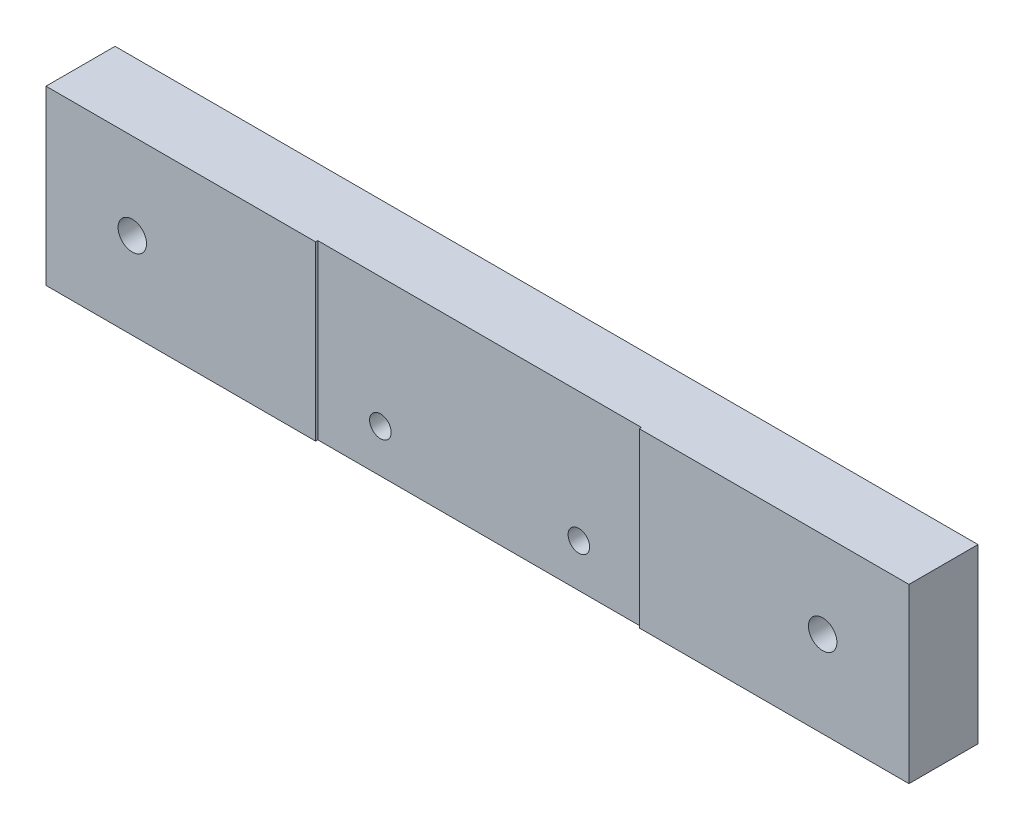
ISO-10303-21;
HEADER;
FILE_DESCRIPTION(('STEP AP214'),'2;1');
FILE_NAME('part.step','',(''),(''),'','','');
FILE_SCHEMA(('AUTOMOTIVE_DESIGN { 1 0 10303 214 1 1 1 1 }'));
ENDSEC;
DATA;
#1=APPLICATION_CONTEXT('core data for automotive mechanical design processes');
#2=APPLICATION_PROTOCOL_DEFINITION('international standard','automotive_design',2000,#1);
#3=PRODUCT_CONTEXT('',#1,'mechanical');
#4=PRODUCT('Part','Part','',(#3));
#5=PRODUCT_RELATED_PRODUCT_CATEGORY('part','',(#4));
#6=PRODUCT_DEFINITION_FORMATION('','',#4);
#7=PRODUCT_DEFINITION_CONTEXT('part definition',#1,'design');
#8=PRODUCT_DEFINITION('design','',#6,#7);
#9=PRODUCT_DEFINITION_SHAPE('','',#8);
#10=(LENGTH_UNIT() NAMED_UNIT(*) SI_UNIT(.MILLI.,.METRE.));
#11=(NAMED_UNIT(*) PLANE_ANGLE_UNIT() SI_UNIT($,.RADIAN.));
#12=(NAMED_UNIT(*) SI_UNIT($,.STERADIAN.) SOLID_ANGLE_UNIT());
#13=UNCERTAINTY_MEASURE_WITH_UNIT(LENGTH_MEASURE(1.E-05),#10,'distance_accuracy_value','');
#14=(GEOMETRIC_REPRESENTATION_CONTEXT(3) GLOBAL_UNCERTAINTY_ASSIGNED_CONTEXT((#13)) GLOBAL_UNIT_ASSIGNED_CONTEXT((#10,
#11,#12)) REPRESENTATION_CONTEXT('',''));
#15=CARTESIAN_POINT('',(0.,0.,0.));
#16=DIRECTION('',(0.,0.,1.));
#17=DIRECTION('',(1.,0.,0.));
#18=AXIS2_PLACEMENT_3D('',#15,#16,#17);
#19=CARTESIAN_POINT('',(-100.,20.,16.));
#20=DIRECTION('',(0.,-1.,0.));
#21=DIRECTION('',(0.,0.,-1.));
#22=AXIS2_PLACEMENT_3D('',#19,#20,#21);
#23=PLANE('',#22);
#24=DIRECTION('',(0.,0.,1.));
#25=VECTOR('',#24,1.);
#26=CARTESIAN_POINT('',(-37.5,20.,15.5));
#27=LINE('',#26,#25);
#28=CARTESIAN_POINT('',(-37.5,20.,15.5));
#29=VERTEX_POINT('',#28);
#30=CARTESIAN_POINT('',(-37.5,20.,16.));
#31=VERTEX_POINT('',#30);
#32=EDGE_CURVE('E127',#29,#31,#27,.T.);
#33=ORIENTED_EDGE('',*,*,#32,.F.);
#34=DIRECTION('',(1.,0.,0.));
#35=VECTOR('',#34,1.);
#36=CARTESIAN_POINT('',(37.5,20.,15.5));
#37=LINE('',#36,#35);
#38=CARTESIAN_POINT('',(37.5,20.,15.5));
#39=VERTEX_POINT('',#38);
#40=EDGE_CURVE('E116',#29,#39,#37,.T.);
#41=ORIENTED_EDGE('',*,*,#40,.T.);
#42=DIRECTION('',(0.,0.,1.));
#43=VECTOR('',#42,1.);
#44=CARTESIAN_POINT('',(37.5,20.,15.5));
#45=LINE('',#44,#43);
#46=CARTESIAN_POINT('',(37.5,20.,16.));
#47=VERTEX_POINT('',#46);
#48=EDGE_CURVE('E137',#39,#47,#45,.T.);
#49=ORIENTED_EDGE('',*,*,#48,.T.);
#50=DIRECTION('',(-1.,0.,0.));
#51=VECTOR('',#50,1.);
#52=CARTESIAN_POINT('',(-100.,20.,16.));
#53=LINE('',#52,#51);
#54=CARTESIAN_POINT('',(100.,20.,16.));
#55=VERTEX_POINT('',#54);
#56=EDGE_CURVE('E92',#55,#47,#53,.T.);
#57=ORIENTED_EDGE('',*,*,#56,.F.);
#58=DIRECTION('',(0.,0.,-1.));
#59=VECTOR('',#58,1.);
#60=CARTESIAN_POINT('',(100.,20.,16.));
#61=LINE('',#60,#59);
#62=CARTESIAN_POINT('',(100.,20.,0.));
#63=VERTEX_POINT('',#62);
#64=EDGE_CURVE('E11',#55,#63,#61,.T.);
#65=ORIENTED_EDGE('',*,*,#64,.T.);
#66=DIRECTION('',(-1.,0.,0.));
#67=VECTOR('',#66,1.);
#68=CARTESIAN_POINT('',(-100.,20.,0.));
#69=LINE('',#68,#67);
#70=CARTESIAN_POINT('',(-100.,20.,0.));
#71=VERTEX_POINT('',#70);
#72=EDGE_CURVE('E140',#63,#71,#69,.T.);
#73=ORIENTED_EDGE('',*,*,#72,.T.);
#74=DIRECTION('',(0.,0.,-1.));
#75=VECTOR('',#74,1.);
#76=CARTESIAN_POINT('',(-100.,20.,16.));
#77=LINE('',#76,#75);
#78=CARTESIAN_POINT('',(-100.,20.,16.));
#79=VERTEX_POINT('',#78);
#80=EDGE_CURVE('E48',#79,#71,#77,.T.);
#81=ORIENTED_EDGE('',*,*,#80,.F.);
#82=EDGE_CURVE('E135',#31,#79,#53,.T.);
#83=ORIENTED_EDGE('',*,*,#82,.F.);
#84=EDGE_LOOP('',(#33,#41,#49,#57,#65,#73,#81,#83));
#85=FACE_BOUND('',#84,.T.);
#86=ADVANCED_FACE('F40',(#85),#23,.F.);
#87=CARTESIAN_POINT('',(-100.,-20.,16.));
#88=DIRECTION('',(0.,1.,0.));
#89=DIRECTION('',(0.,0.,1.));
#90=AXIS2_PLACEMENT_3D('',#87,#88,#89);
#91=PLANE('',#90);
#92=DIRECTION('',(0.,0.,1.));
#93=VECTOR('',#92,1.);
#94=CARTESIAN_POINT('',(-37.5,-20.,15.5));
#95=LINE('',#94,#93);
#96=CARTESIAN_POINT('',(-37.5,-20.,15.5));
#97=VERTEX_POINT('',#96);
#98=CARTESIAN_POINT('',(-37.5,-20.,16.));
#99=VERTEX_POINT('',#98);
#100=EDGE_CURVE('E130',#97,#99,#95,.T.);
#101=ORIENTED_EDGE('',*,*,#100,.T.);
#102=DIRECTION('',(1.,0.,0.));
#103=VECTOR('',#102,1.);
#104=CARTESIAN_POINT('',(-100.,-20.,16.));
#105=LINE('',#104,#103);
#106=CARTESIAN_POINT('',(-100.,-20.,16.));
#107=VERTEX_POINT('',#106);
#108=EDGE_CURVE('E150',#107,#99,#105,.T.);
#109=ORIENTED_EDGE('',*,*,#108,.F.);
#110=DIRECTION('',(0.,0.,-1.));
#111=VECTOR('',#110,1.);
#112=CARTESIAN_POINT('',(-100.,-20.,16.));
#113=LINE('',#112,#111);
#114=CARTESIAN_POINT('',(-100.,-20.,0.));
#115=VERTEX_POINT('',#114);
#116=EDGE_CURVE('E159',#107,#115,#113,.T.);
#117=ORIENTED_EDGE('',*,*,#116,.T.);
#118=DIRECTION('',(1.,0.,0.));
#119=VECTOR('',#118,1.);
#120=CARTESIAN_POINT('',(-100.,-20.,0.));
#121=LINE('',#120,#119);
#122=CARTESIAN_POINT('',(100.,-20.,0.));
#123=VERTEX_POINT('',#122);
#124=EDGE_CURVE('E85',#115,#123,#121,.T.);
#125=ORIENTED_EDGE('',*,*,#124,.T.);
#126=DIRECTION('',(0.,0.,-1.));
#127=VECTOR('',#126,1.);
#128=CARTESIAN_POINT('',(100.,-20.,16.));
#129=LINE('',#128,#127);
#130=CARTESIAN_POINT('',(100.,-20.,16.));
#131=VERTEX_POINT('',#130);
#132=EDGE_CURVE('E152',#131,#123,#129,.T.);
#133=ORIENTED_EDGE('',*,*,#132,.F.);
#134=CARTESIAN_POINT('',(37.5,-20.,16.));
#135=VERTEX_POINT('',#134);
#136=EDGE_CURVE('E63',#135,#131,#105,.T.);
#137=ORIENTED_EDGE('',*,*,#136,.F.);
#138=DIRECTION('',(0.,0.,1.));
#139=VECTOR('',#138,1.);
#140=CARTESIAN_POINT('',(37.5,-20.,15.5));
#141=LINE('',#140,#139);
#142=CARTESIAN_POINT('',(37.5,-20.,15.5));
#143=VERTEX_POINT('',#142);
#144=EDGE_CURVE('E55',#143,#135,#141,.T.);
#145=ORIENTED_EDGE('',*,*,#144,.F.);
#146=DIRECTION('',(-1.,0.,0.));
#147=VECTOR('',#146,1.);
#148=CARTESIAN_POINT('',(37.5,-20.,15.5));
#149=LINE('',#148,#147);
#150=EDGE_CURVE('E173',#143,#97,#149,.T.);
#151=ORIENTED_EDGE('',*,*,#150,.T.);
#152=EDGE_LOOP('',(#101,#109,#117,#125,#133,#137,#145,#151));
#153=FACE_BOUND('',#152,.T.);
#154=ADVANCED_FACE('F172',(#153),#91,.F.);
#155=CARTESIAN_POINT('',(0.,0.,16.));
#156=DIRECTION('',(0.,0.,1.));
#157=DIRECTION('',(1.,0.,0.));
#158=AXIS2_PLACEMENT_3D('',#155,#156,#157);
#159=PLANE('',#158);
#160=CARTESIAN_POINT('',(-80.,0.,16.));
#161=DIRECTION('',(0.,0.,-1.));
#162=DIRECTION('',(-1.,0.,0.));
#163=AXIS2_PLACEMENT_3D('',#160,#161,#162);
#164=CIRCLE('',#163,3.3);
#165=CARTESIAN_POINT('',(-83.3,0.,16.));
#166=VERTEX_POINT('',#165);
#167=EDGE_CURVE('E193',#166,#166,#164,.T.);
#168=ORIENTED_EDGE('',*,*,#167,.T.);
#169=EDGE_LOOP('',(#168));
#170=FACE_BOUND('',#169,.T.);
#171=ORIENTED_EDGE('',*,*,#108,.T.);
#172=DIRECTION('',(0.,1.,0.));
#173=VECTOR('',#172,1.);
#174=CARTESIAN_POINT('',(-37.5,20.,16.));
#175=LINE('',#174,#173);
#176=EDGE_CURVE('E177',#99,#31,#175,.T.);
#177=ORIENTED_EDGE('',*,*,#176,.T.);
#178=ORIENTED_EDGE('',*,*,#82,.T.);
#179=DIRECTION('',(0.,-1.,0.));
#180=VECTOR('',#179,1.);
#181=CARTESIAN_POINT('',(-100.,20.,16.));
#182=LINE('',#181,#180);
#183=EDGE_CURVE('E148',#79,#107,#182,.T.);
#184=ORIENTED_EDGE('',*,*,#183,.T.);
#185=EDGE_LOOP('',(#171,#177,#178,#184));
#186=FACE_BOUND('',#185,.T.);
#187=ADVANCED_FACE('F249',(#170,#186),#159,.T.);
#188=CARTESIAN_POINT('',(80.,0.,16.));
#189=DIRECTION('',(0.,0.,-1.));
#190=DIRECTION('',(-1.,0.,0.));
#191=AXIS2_PLACEMENT_3D('',#188,#189,#190);
#192=CIRCLE('',#191,3.3);
#193=CARTESIAN_POINT('',(76.7,0.,16.));
#194=VERTEX_POINT('',#193);
#195=EDGE_CURVE('E205',#194,#194,#192,.T.);
#196=ORIENTED_EDGE('',*,*,#195,.T.);
#197=EDGE_LOOP('',(#196));
#198=FACE_BOUND('',#197,.T.);
#199=ORIENTED_EDGE('',*,*,#56,.T.);
#200=DIRECTION('',(0.,-1.,0.));
#201=VECTOR('',#200,1.);
#202=CARTESIAN_POINT('',(37.5,20.,16.));
#203=LINE('',#202,#201);
#204=EDGE_CURVE('E131',#47,#135,#203,.T.);
#205=ORIENTED_EDGE('',*,*,#204,.T.);
#206=ORIENTED_EDGE('',*,*,#136,.T.);
#207=DIRECTION('',(0.,1.,0.));
#208=VECTOR('',#207,1.);
#209=CARTESIAN_POINT('',(100.,20.,16.));
#210=LINE('',#209,#208);
#211=EDGE_CURVE('E145',#131,#55,#210,.T.);
#212=ORIENTED_EDGE('',*,*,#211,.T.);
#213=EDGE_LOOP('',(#199,#205,#206,#212));
#214=FACE_BOUND('',#213,.T.);
#215=ADVANCED_FACE('F256',(#198,#214),#159,.T.);
#216=CARTESIAN_POINT('',(100.,20.,16.));
#217=DIRECTION('',(-1.,0.,0.));
#218=DIRECTION('',(0.,0.,1.));
#219=AXIS2_PLACEMENT_3D('',#216,#217,#218);
#220=PLANE('',#219);
#221=DIRECTION('',(0.,1.,0.));
#222=VECTOR('',#221,1.);
#223=CARTESIAN_POINT('',(100.,20.,0.));
#224=LINE('',#223,#222);
#225=EDGE_CURVE('E136',#123,#63,#224,.T.);
#226=ORIENTED_EDGE('',*,*,#225,.T.);
#227=ORIENTED_EDGE('',*,*,#64,.F.);
#228=ORIENTED_EDGE('',*,*,#211,.F.);
#229=ORIENTED_EDGE('',*,*,#132,.T.);
#230=EDGE_LOOP('',(#226,#227,#228,#229));
#231=FACE_BOUND('',#230,.T.);
#232=ADVANCED_FACE('F42',(#231),#220,.F.);
#233=CARTESIAN_POINT('',(-100.,20.,16.));
#234=DIRECTION('',(1.,0.,0.));
#235=DIRECTION('',(0.,0.,-1.));
#236=AXIS2_PLACEMENT_3D('',#233,#234,#235);
#237=PLANE('',#236);
#238=DIRECTION('',(0.,-1.,0.));
#239=VECTOR('',#238,1.);
#240=CARTESIAN_POINT('',(-100.,20.,0.));
#241=LINE('',#240,#239);
#242=EDGE_CURVE('E155',#71,#115,#241,.T.);
#243=ORIENTED_EDGE('',*,*,#242,.T.);
#244=ORIENTED_EDGE('',*,*,#116,.F.);
#245=ORIENTED_EDGE('',*,*,#183,.F.);
#246=ORIENTED_EDGE('',*,*,#80,.T.);
#247=EDGE_LOOP('',(#243,#244,#245,#246));
#248=FACE_BOUND('',#247,.T.);
#249=ADVANCED_FACE('F164',(#248),#237,.F.);
#250=CARTESIAN_POINT('',(0.,0.,0.));
#251=DIRECTION('',(0.,0.,1.));
#252=DIRECTION('',(1.,0.,0.));
#253=AXIS2_PLACEMENT_3D('',#250,#251,#252);
#254=PLANE('',#253);
#255=CARTESIAN_POINT('',(80.,0.,0.));
#256=DIRECTION('',(0.,0.,-1.));
#257=DIRECTION('',(-1.,0.,0.));
#258=AXIS2_PLACEMENT_3D('',#255,#256,#257);
#259=CIRCLE('',#258,5.49999999999999);
#260=CARTESIAN_POINT('',(74.5,0.,0.));
#261=VERTEX_POINT('',#260);
#262=EDGE_CURVE('E214',#261,#261,#259,.T.);
#263=ORIENTED_EDGE('',*,*,#262,.F.);
#264=EDGE_LOOP('',(#263));
#265=FACE_BOUND('',#264,.T.);
#266=CARTESIAN_POINT('',(-80.,0.,0.));
#267=DIRECTION('',(0.,0.,-1.));
#268=DIRECTION('',(-1.,0.,0.));
#269=AXIS2_PLACEMENT_3D('',#266,#267,#268);
#270=CIRCLE('',#269,5.49999999999999);
#271=CARTESIAN_POINT('',(-85.5,0.,0.));
#272=VERTEX_POINT('',#271);
#273=EDGE_CURVE('E202',#272,#272,#270,.T.);
#274=ORIENTED_EDGE('',*,*,#273,.F.);
#275=EDGE_LOOP('',(#274));
#276=FACE_BOUND('',#275,.T.);
#277=CARTESIAN_POINT('',(-23.,-10.0000000000032,0.));
#278=DIRECTION('',(0.,0.,1.));
#279=DIRECTION('',(1.,0.,0.));
#280=AXIS2_PLACEMENT_3D('',#277,#278,#279);
#281=CIRCLE('',#280,2.5);
#282=CARTESIAN_POINT('',(-20.5,-10.0000000000032,0.));
#283=VERTEX_POINT('',#282);
#284=EDGE_CURVE('E187',#283,#283,#281,.T.);
#285=ORIENTED_EDGE('',*,*,#284,.T.);
#286=EDGE_LOOP('',(#285));
#287=FACE_BOUND('',#286,.T.);
#288=CARTESIAN_POINT('',(23.,-10.0000000000032,0.));
#289=DIRECTION('',(0.,0.,1.));
#290=DIRECTION('',(1.,0.,0.));
#291=AXIS2_PLACEMENT_3D('',#288,#289,#290);
#292=CIRCLE('',#291,2.5);
#293=CARTESIAN_POINT('',(25.5,-10.0000000000032,0.));
#294=VERTEX_POINT('',#293);
#295=EDGE_CURVE('E179',#294,#294,#292,.T.);
#296=ORIENTED_EDGE('',*,*,#295,.T.);
#297=EDGE_LOOP('',(#296));
#298=FACE_BOUND('',#297,.T.);
#299=ORIENTED_EDGE('',*,*,#225,.F.);
#300=ORIENTED_EDGE('',*,*,#124,.F.);
#301=ORIENTED_EDGE('',*,*,#242,.F.);
#302=ORIENTED_EDGE('',*,*,#72,.F.);
#303=EDGE_LOOP('',(#299,#300,#301,#302));
#304=FACE_BOUND('',#303,.T.);
#305=ADVANCED_FACE('F168',(#265,#276,#287,#298,#304),#254,.F.);
#306=CARTESIAN_POINT('',(-37.5,20.,15.5));
#307=DIRECTION('',(1.,0.,0.));
#308=DIRECTION('',(0.,0.,-1.));
#309=AXIS2_PLACEMENT_3D('',#306,#307,#308);
#310=PLANE('',#309);
#311=ORIENTED_EDGE('',*,*,#176,.F.);
#312=ORIENTED_EDGE('',*,*,#100,.F.);
#313=DIRECTION('',(0.,1.,0.));
#314=VECTOR('',#313,1.);
#315=CARTESIAN_POINT('',(-37.5,20.,15.5));
#316=LINE('',#315,#314);
#317=EDGE_CURVE('E120',#97,#29,#316,.T.);
#318=ORIENTED_EDGE('',*,*,#317,.T.);
#319=ORIENTED_EDGE('',*,*,#32,.T.);
#320=EDGE_LOOP('',(#311,#312,#318,#319));
#321=FACE_BOUND('',#320,.T.);
#322=ADVANCED_FACE('F126',(#321),#310,.T.);
#323=CARTESIAN_POINT('',(37.5,20.,15.5));
#324=DIRECTION('',(-1.,0.,0.));
#325=DIRECTION('',(0.,-1.,0.));
#326=AXIS2_PLACEMENT_3D('',#323,#324,#325);
#327=PLANE('',#326);
#328=ORIENTED_EDGE('',*,*,#204,.F.);
#329=ORIENTED_EDGE('',*,*,#48,.F.);
#330=DIRECTION('',(0.,-1.,0.));
#331=VECTOR('',#330,1.);
#332=CARTESIAN_POINT('',(37.5,20.,15.5));
#333=LINE('',#332,#331);
#334=EDGE_CURVE('E122',#39,#143,#333,.T.);
#335=ORIENTED_EDGE('',*,*,#334,.T.);
#336=ORIENTED_EDGE('',*,*,#144,.T.);
#337=EDGE_LOOP('',(#328,#329,#335,#336));
#338=FACE_BOUND('',#337,.T.);
#339=ADVANCED_FACE('F237',(#338),#327,.T.);
#340=CARTESIAN_POINT('',(0.,0.,15.5));
#341=DIRECTION('',(0.,0.,-1.));
#342=DIRECTION('',(-1.,0.,0.));
#343=AXIS2_PLACEMENT_3D('',#340,#341,#342);
#344=PLANE('',#343);
#345=CARTESIAN_POINT('',(-23.,-10.0000000000032,15.5));
#346=DIRECTION('',(0.,0.,1.));
#347=DIRECTION('',(1.,0.,0.));
#348=AXIS2_PLACEMENT_3D('',#345,#346,#347);
#349=CIRCLE('',#348,2.5);
#350=CARTESIAN_POINT('',(-20.5,-10.0000000000032,15.5));
#351=VERTEX_POINT('',#350);
#352=EDGE_CURVE('E190',#351,#351,#349,.T.);
#353=ORIENTED_EDGE('',*,*,#352,.F.);
#354=EDGE_LOOP('',(#353));
#355=FACE_BOUND('',#354,.T.);
#356=CARTESIAN_POINT('',(23.,-10.0000000000032,15.5));
#357=DIRECTION('',(0.,0.,1.));
#358=DIRECTION('',(1.,0.,0.));
#359=AXIS2_PLACEMENT_3D('',#356,#357,#358);
#360=CIRCLE('',#359,2.5);
#361=CARTESIAN_POINT('',(25.5,-10.0000000000032,15.5));
#362=VERTEX_POINT('',#361);
#363=EDGE_CURVE('E184',#362,#362,#360,.T.);
#364=ORIENTED_EDGE('',*,*,#363,.F.);
#365=EDGE_LOOP('',(#364));
#366=FACE_BOUND('',#365,.T.);
#367=ORIENTED_EDGE('',*,*,#317,.F.);
#368=ORIENTED_EDGE('',*,*,#150,.F.);
#369=ORIENTED_EDGE('',*,*,#334,.F.);
#370=ORIENTED_EDGE('',*,*,#40,.F.);
#371=EDGE_LOOP('',(#367,#368,#369,#370));
#372=FACE_BOUND('',#371,.T.);
#373=ADVANCED_FACE('F118',(#355,#366,#372),#344,.F.);
#374=CARTESIAN_POINT('',(23.,-10.0000000000032,15.5));
#375=DIRECTION('',(0.,0.,1.));
#376=DIRECTION('',(1.,0.,0.));
#377=AXIS2_PLACEMENT_3D('',#374,#375,#376);
#378=CYLINDRICAL_SURFACE('',#377,2.5);
#379=ORIENTED_EDGE('',*,*,#295,.F.);
#380=EDGE_LOOP('',(#379));
#381=FACE_BOUND('',#380,.T.);
#382=ORIENTED_EDGE('',*,*,#363,.T.);
#383=EDGE_LOOP('',(#382));
#384=FACE_BOUND('',#383,.T.);
#385=ADVANCED_FACE('F229',(#381,#384),#378,.F.);
#386=CARTESIAN_POINT('',(-23.,-10.0000000000032,15.5));
#387=DIRECTION('',(0.,0.,1.));
#388=DIRECTION('',(1.,0.,0.));
#389=AXIS2_PLACEMENT_3D('',#386,#387,#388);
#390=CYLINDRICAL_SURFACE('',#389,2.5);
#391=ORIENTED_EDGE('',*,*,#284,.F.);
#392=EDGE_LOOP('',(#391));
#393=FACE_BOUND('',#392,.T.);
#394=ORIENTED_EDGE('',*,*,#352,.T.);
#395=EDGE_LOOP('',(#394));
#396=FACE_BOUND('',#395,.T.);
#397=ADVANCED_FACE('F232',(#393,#396),#390,.F.);
#398=CARTESIAN_POINT('',(-80.,0.,0.));
#399=DIRECTION('',(0.,0.,-1.));
#400=DIRECTION('',(-1.,0.,0.));
#401=AXIS2_PLACEMENT_3D('',#398,#399,#400);
#402=CYLINDRICAL_SURFACE('',#401,3.3);
#403=ORIENTED_EDGE('',*,*,#167,.F.);
#404=EDGE_LOOP('',(#403));
#405=FACE_BOUND('',#404,.T.);
#406=CARTESIAN_POINT('',(-80.,0.,6.4));
#407=DIRECTION('',(0.,0.,-1.));
#408=DIRECTION('',(-1.,0.,0.));
#409=AXIS2_PLACEMENT_3D('',#406,#407,#408);
#410=CIRCLE('',#409,3.30000000000001);
#411=CARTESIAN_POINT('',(-83.3,0.,6.4));
#412=VERTEX_POINT('',#411);
#413=EDGE_CURVE('E196',#412,#412,#410,.T.);
#414=ORIENTED_EDGE('',*,*,#413,.T.);
#415=EDGE_LOOP('',(#414));
#416=FACE_BOUND('',#415,.T.);
#417=ADVANCED_FACE('F294',(#405,#416),#402,.F.);
#418=CARTESIAN_POINT('',(-76.7,0.,6.4));
#419=DIRECTION('',(0.,0.,1.));
#420=DIRECTION('',(1.,0.,0.));
#421=AXIS2_PLACEMENT_3D('',#418,#419,#420);
#422=PLANE('',#421);
#423=ORIENTED_EDGE('',*,*,#413,.F.);
#424=EDGE_LOOP('',(#423));
#425=FACE_BOUND('',#424,.T.);
#426=CARTESIAN_POINT('',(-80.,0.,6.4));
#427=DIRECTION('',(0.,0.,-1.));
#428=DIRECTION('',(-1.,0.,0.));
#429=AXIS2_PLACEMENT_3D('',#426,#427,#428);
#430=CIRCLE('',#429,5.49999999999999);
#431=CARTESIAN_POINT('',(-85.5,0.,6.4));
#432=VERTEX_POINT('',#431);
#433=EDGE_CURVE('E199',#432,#432,#430,.T.);
#434=ORIENTED_EDGE('',*,*,#433,.T.);
#435=EDGE_LOOP('',(#434));
#436=FACE_BOUND('',#435,.T.);
#437=ADVANCED_FACE('F325',(#425,#436),#422,.F.);
#438=CARTESIAN_POINT('',(-80.,0.,0.));
#439=DIRECTION('',(0.,0.,-1.));
#440=DIRECTION('',(-1.,0.,0.));
#441=AXIS2_PLACEMENT_3D('',#438,#439,#440);
#442=CYLINDRICAL_SURFACE('',#441,5.49999999999999);
#443=ORIENTED_EDGE('',*,*,#433,.F.);
#444=EDGE_LOOP('',(#443));
#445=FACE_BOUND('',#444,.T.);
#446=ORIENTED_EDGE('',*,*,#273,.T.);
#447=EDGE_LOOP('',(#446));
#448=FACE_BOUND('',#447,.T.);
#449=ADVANCED_FACE('F335',(#445,#448),#442,.F.);
#450=CARTESIAN_POINT('',(80.,0.,0.));
#451=DIRECTION('',(0.,0.,-1.));
#452=DIRECTION('',(-1.,0.,0.));
#453=AXIS2_PLACEMENT_3D('',#450,#451,#452);
#454=CYLINDRICAL_SURFACE('',#453,3.3);
#455=ORIENTED_EDGE('',*,*,#195,.F.);
#456=EDGE_LOOP('',(#455));
#457=FACE_BOUND('',#456,.T.);
#458=CARTESIAN_POINT('',(80.,0.,6.4));
#459=DIRECTION('',(0.,0.,-1.));
#460=DIRECTION('',(-1.,0.,0.));
#461=AXIS2_PLACEMENT_3D('',#458,#459,#460);
#462=CIRCLE('',#461,3.30000000000001);
#463=CARTESIAN_POINT('',(76.7,0.,6.4));
#464=VERTEX_POINT('',#463);
#465=EDGE_CURVE('E208',#464,#464,#462,.T.);
#466=ORIENTED_EDGE('',*,*,#465,.T.);
#467=EDGE_LOOP('',(#466));
#468=FACE_BOUND('',#467,.T.);
#469=ADVANCED_FACE('F345',(#457,#468),#454,.F.);
#470=CARTESIAN_POINT('',(83.3,0.,6.4));
#471=DIRECTION('',(0.,0.,1.));
#472=DIRECTION('',(1.,0.,0.));
#473=AXIS2_PLACEMENT_3D('',#470,#471,#472);
#474=PLANE('',#473);
#475=ORIENTED_EDGE('',*,*,#465,.F.);
#476=EDGE_LOOP('',(#475));
#477=FACE_BOUND('',#476,.T.);
#478=CARTESIAN_POINT('',(80.,0.,6.4));
#479=DIRECTION('',(0.,0.,-1.));
#480=DIRECTION('',(-1.,0.,0.));
#481=AXIS2_PLACEMENT_3D('',#478,#479,#480);
#482=CIRCLE('',#481,5.49999999999999);
#483=CARTESIAN_POINT('',(74.5,0.,6.4));
#484=VERTEX_POINT('',#483);
#485=EDGE_CURVE('E211',#484,#484,#482,.T.);
#486=ORIENTED_EDGE('',*,*,#485,.T.);
#487=EDGE_LOOP('',(#486));
#488=FACE_BOUND('',#487,.T.);
#489=ADVANCED_FACE('F355',(#477,#488),#474,.F.);
#490=CARTESIAN_POINT('',(80.,0.,0.));
#491=DIRECTION('',(0.,0.,-1.));
#492=DIRECTION('',(-1.,0.,0.));
#493=AXIS2_PLACEMENT_3D('',#490,#491,#492);
#494=CYLINDRICAL_SURFACE('',#493,5.49999999999999);
#495=ORIENTED_EDGE('',*,*,#485,.F.);
#496=EDGE_LOOP('',(#495));
#497=FACE_BOUND('',#496,.T.);
#498=ORIENTED_EDGE('',*,*,#262,.T.);
#499=EDGE_LOOP('',(#498));
#500=FACE_BOUND('',#499,.T.);
#501=ADVANCED_FACE('F218',(#497,#500),#494,.F.);
#502=CLOSED_SHELL('',(#86,#154,#187,#215,#232,#249,#305,#322,#339,#373,#385,#397,#417,#437,#449,
#469,#489,#501));
#503=MANIFOLD_SOLID_BREP('B2',#502);
#504=ADVANCED_BREP_SHAPE_REPRESENTATION('',(#18,#503),#14);
#505=SHAPE_DEFINITION_REPRESENTATION(#9,#504);
ENDSEC;
END-ISO-10303-21;
